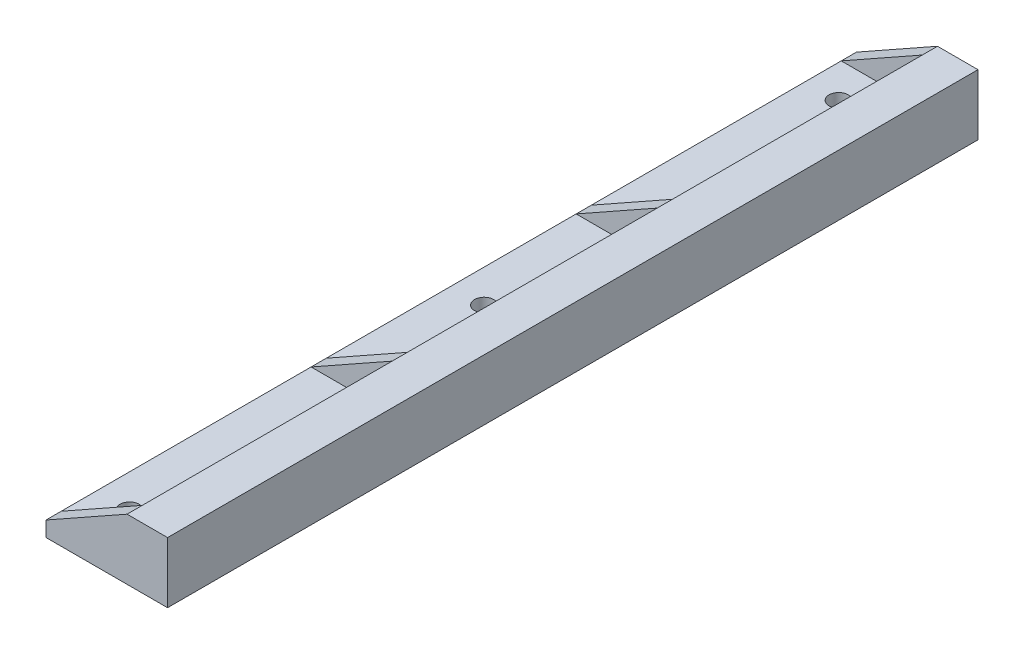
ISO-10303-21;
HEADER;
FILE_DESCRIPTION(('STEP AP214'),'2;1');
FILE_NAME('part.step','',(''),(''),'','','');
FILE_SCHEMA(('AUTOMOTIVE_DESIGN { 1 0 10303 214 1 1 1 1 }'));
ENDSEC;
DATA;
#1=APPLICATION_CONTEXT('core data for automotive mechanical design processes');
#2=APPLICATION_PROTOCOL_DEFINITION('international standard','automotive_design',2000,#1);
#3=PRODUCT_CONTEXT('',#1,'mechanical');
#4=PRODUCT('Part','Part','',(#3));
#5=PRODUCT_RELATED_PRODUCT_CATEGORY('part','',(#4));
#6=PRODUCT_DEFINITION_FORMATION('','',#4);
#7=PRODUCT_DEFINITION_CONTEXT('part definition',#1,'design');
#8=PRODUCT_DEFINITION('design','',#6,#7);
#9=PRODUCT_DEFINITION_SHAPE('','',#8);
#10=(LENGTH_UNIT() NAMED_UNIT(*) SI_UNIT(.MILLI.,.METRE.));
#11=(NAMED_UNIT(*) PLANE_ANGLE_UNIT() SI_UNIT($,.RADIAN.));
#12=(NAMED_UNIT(*) SI_UNIT($,.STERADIAN.) SOLID_ANGLE_UNIT());
#13=UNCERTAINTY_MEASURE_WITH_UNIT(LENGTH_MEASURE(1.E-05),#10,'distance_accuracy_value','');
#14=(GEOMETRIC_REPRESENTATION_CONTEXT(3) GLOBAL_UNCERTAINTY_ASSIGNED_CONTEXT((#13)) GLOBAL_UNIT_ASSIGNED_CONTEXT((#10,
#11,#12)) REPRESENTATION_CONTEXT('',''));
#15=CARTESIAN_POINT('',(0.,0.,0.));
#16=DIRECTION('',(0.,0.,1.));
#17=DIRECTION('',(1.,0.,0.));
#18=AXIS2_PLACEMENT_3D('',#15,#16,#17);
#19=CARTESIAN_POINT('',(-11.,6.,160.));
#20=DIRECTION('',(0.,0.,-1.));
#21=DIRECTION('',(-1.,0.,0.));
#22=AXIS2_PLACEMENT_3D('',#19,#20,#21);
#23=CYLINDRICAL_SURFACE('',#22,3.);
#24=CARTESIAN_POINT('',(-11.,6.,157.));
#25=DIRECTION('',(0.,0.,1.));
#26=DIRECTION('',(1.,0.,0.));
#27=AXIS2_PLACEMENT_3D('',#24,#25,#26);
#28=CIRCLE('',#27,3.);
#29=CARTESIAN_POINT('',(-8.,6.,157.));
#30=VERTEX_POINT('',#29);
#31=CARTESIAN_POINT('',(-11.,3.,157.));
#32=VERTEX_POINT('',#31);
#33=EDGE_CURVE('E212',#30,#32,#28,.F.);
#34=ORIENTED_EDGE('',*,*,#33,.F.);
#35=DIRECTION('',(0.,0.,-1.));
#36=VECTOR('',#35,1.);
#37=CARTESIAN_POINT('',(-8.,6.,160.));
#38=LINE('',#37,#36);
#39=CARTESIAN_POINT('',(-8.,6.,107.66666666));
#40=VERTEX_POINT('',#39);
#41=EDGE_CURVE('E294',#30,#40,#38,.T.);
#42=ORIENTED_EDGE('',*,*,#41,.T.);
#43=CARTESIAN_POINT('',(-11.,6.,107.66666666));
#44=DIRECTION('',(0.,0.,1.));
#45=DIRECTION('',(1.,0.,0.));
#46=AXIS2_PLACEMENT_3D('',#43,#44,#45);
#47=CIRCLE('',#46,3.);
#48=CARTESIAN_POINT('',(-11.,3.,107.66666666));
#49=VERTEX_POINT('',#48);
#50=EDGE_CURVE('E232',#40,#49,#47,.F.);
#51=ORIENTED_EDGE('',*,*,#50,.T.);
#52=DIRECTION('',(0.,0.,-1.));
#53=VECTOR('',#52,1.);
#54=CARTESIAN_POINT('',(-11.,3.,160.));
#55=LINE('',#54,#53);
#56=EDGE_CURVE('E61',#32,#49,#55,.T.);
#57=ORIENTED_EDGE('',*,*,#56,.F.);
#58=EDGE_LOOP('',(#34,#42,#51,#57));
#59=FACE_BOUND('',#58,.T.);
#60=ADVANCED_FACE('F38',(#59),#23,.F.);
#61=CARTESIAN_POINT('',(-11.,3.,160.));
#62=DIRECTION('',(0.,-1.,0.));
#63=DIRECTION('',(1.,0.,0.));
#64=AXIS2_PLACEMENT_3D('',#61,#62,#63);
#65=PLANE('',#64);
#66=CARTESIAN_POINT('',(-17.4997499999984,3.,150.));
#67=DIRECTION('',(0.,-1.,0.));
#68=DIRECTION('',(1.,0.,0.));
#69=AXIS2_PLACEMENT_3D('',#66,#67,#68);
#70=CIRCLE('',#69,1.89864999999999);
#71=CARTESIAN_POINT('',(-15.6010999999984,3.,150.));
#72=VERTEX_POINT('',#71);
#73=EDGE_CURVE('E199',#72,#72,#70,.T.);
#74=ORIENTED_EDGE('',*,*,#73,.T.);
#75=EDGE_LOOP('',(#74));
#76=FACE_BOUND('',#75,.T.);
#77=DIRECTION('',(-1.,0.,0.));
#78=VECTOR('',#77,1.);
#79=CARTESIAN_POINT('',(-11.,3.,157.));
#80=LINE('',#79,#78);
#81=CARTESIAN_POINT('',(-24.,3.,157.));
#82=VERTEX_POINT('',#81);
#83=EDGE_CURVE('E210',#32,#82,#80,.T.);
#84=ORIENTED_EDGE('',*,*,#83,.F.);
#85=ORIENTED_EDGE('',*,*,#56,.T.);
#86=DIRECTION('',(-1.,0.,0.));
#87=VECTOR('',#86,1.);
#88=CARTESIAN_POINT('',(-11.,3.,107.66666666));
#89=LINE('',#88,#87);
#90=CARTESIAN_POINT('',(-24.,3.,107.66666666));
#91=VERTEX_POINT('',#90);
#92=EDGE_CURVE('E230',#49,#91,#89,.T.);
#93=ORIENTED_EDGE('',*,*,#92,.T.);
#94=DIRECTION('',(0.,0.,-1.));
#95=VECTOR('',#94,1.);
#96=CARTESIAN_POINT('',(-24.,3.,160.));
#97=LINE('',#96,#95);
#98=EDGE_CURVE('E313',#82,#91,#97,.T.);
#99=ORIENTED_EDGE('',*,*,#98,.F.);
#100=EDGE_LOOP('',(#84,#85,#93,#99));
#101=FACE_BOUND('',#100,.T.);
#102=ADVANCED_FACE('F394',(#76,#101),#65,.F.);
#103=CARTESIAN_POINT('',(-8.,12.,160.));
#104=DIRECTION('',(1.,0.,0.));
#105=DIRECTION('',(0.,0.,-1.));
#106=AXIS2_PLACEMENT_3D('',#103,#104,#105);
#107=PLANE('',#106);
#108=DIRECTION('',(0.,-1.,0.));
#109=VECTOR('',#108,1.);
#110=CARTESIAN_POINT('',(-8.,12.,157.));
#111=LINE('',#110,#109);
#112=CARTESIAN_POINT('',(-8.,12.,157.));
#113=VERTEX_POINT('',#112);
#114=EDGE_CURVE('E206',#113,#30,#111,.T.);
#115=ORIENTED_EDGE('',*,*,#114,.F.);
#116=DIRECTION('',(0.,0.,-1.));
#117=VECTOR('',#116,1.);
#118=CARTESIAN_POINT('',(-8.,12.,160.));
#119=LINE('',#118,#117);
#120=CARTESIAN_POINT('',(-8.,12.,107.66666666));
#121=VERTEX_POINT('',#120);
#122=EDGE_CURVE('E301',#113,#121,#119,.T.);
#123=ORIENTED_EDGE('',*,*,#122,.T.);
#124=DIRECTION('',(0.,-1.,0.));
#125=VECTOR('',#124,1.);
#126=CARTESIAN_POINT('',(-8.,12.,107.66666666));
#127=LINE('',#126,#125);
#128=EDGE_CURVE('E227',#121,#40,#127,.T.);
#129=ORIENTED_EDGE('',*,*,#128,.T.);
#130=ORIENTED_EDGE('',*,*,#41,.F.);
#131=EDGE_LOOP('',(#115,#123,#129,#130));
#132=FACE_BOUND('',#131,.T.);
#133=ADVANCED_FACE('F364',(#132),#107,.F.);
#134=CARTESIAN_POINT('',(-11.,6.,104.66666666));
#135=DIRECTION('',(0.,0.,1.));
#136=DIRECTION('',(1.,0.,0.));
#137=AXIS2_PLACEMENT_3D('',#134,#135,#136);
#138=CIRCLE('',#137,3.);
#139=CARTESIAN_POINT('',(-8.,6.,104.66666666));
#140=VERTEX_POINT('',#139);
#141=CARTESIAN_POINT('',(-11.,3.,104.66666666));
#142=VERTEX_POINT('',#141);
#143=EDGE_CURVE('E224',#140,#142,#138,.F.);
#144=ORIENTED_EDGE('',*,*,#143,.F.);
#145=CARTESIAN_POINT('',(-8.,6.,55.33333334));
#146=VERTEX_POINT('',#145);
#147=EDGE_CURVE('E297',#140,#146,#38,.T.);
#148=ORIENTED_EDGE('',*,*,#147,.T.);
#149=CARTESIAN_POINT('',(-11.,6.,55.33333334));
#150=DIRECTION('',(0.,0.,-1.));
#151=DIRECTION('',(-1.,0.,0.));
#152=AXIS2_PLACEMENT_3D('',#149,#150,#151);
#153=CIRCLE('',#152,3.);
#154=CARTESIAN_POINT('',(-11.,3.,55.33333334));
#155=VERTEX_POINT('',#154);
#156=EDGE_CURVE('E263',#155,#146,#153,.F.);
#157=ORIENTED_EDGE('',*,*,#156,.F.);
#158=EDGE_CURVE('E316',#142,#155,#55,.T.);
#159=ORIENTED_EDGE('',*,*,#158,.F.);
#160=EDGE_LOOP('',(#144,#148,#157,#159));
#161=FACE_BOUND('',#160,.T.);
#162=ADVANCED_FACE('F351',(#161),#23,.F.);
#163=CARTESIAN_POINT('',(-17.4997499999984,3.,80.0000000000001));
#164=DIRECTION('',(0.,-1.,0.));
#165=DIRECTION('',(1.,0.,0.));
#166=AXIS2_PLACEMENT_3D('',#163,#164,#165);
#167=CIRCLE('',#166,1.89864999999999);
#168=CARTESIAN_POINT('',(-15.6010999999984,3.,80.0000000000001));
#169=VERTEX_POINT('',#168);
#170=EDGE_CURVE('E193',#169,#169,#167,.T.);
#171=ORIENTED_EDGE('',*,*,#170,.T.);
#172=EDGE_LOOP('',(#171));
#173=FACE_BOUND('',#172,.T.);
#174=DIRECTION('',(-1.,0.,0.));
#175=VECTOR('',#174,1.);
#176=CARTESIAN_POINT('',(-11.,3.,104.66666666));
#177=LINE('',#176,#175);
#178=CARTESIAN_POINT('',(-24.,3.,104.66666666));
#179=VERTEX_POINT('',#178);
#180=EDGE_CURVE('E53',#142,#179,#177,.T.);
#181=ORIENTED_EDGE('',*,*,#180,.F.);
#182=ORIENTED_EDGE('',*,*,#158,.T.);
#183=DIRECTION('',(1.,0.,0.));
#184=VECTOR('',#183,1.);
#185=CARTESIAN_POINT('',(-11.,3.,55.33333334));
#186=LINE('',#185,#184);
#187=CARTESIAN_POINT('',(-24.,3.,55.33333334));
#188=VERTEX_POINT('',#187);
#189=EDGE_CURVE('E258',#188,#155,#186,.T.);
#190=ORIENTED_EDGE('',*,*,#189,.F.);
#191=EDGE_CURVE('E379',#179,#188,#97,.T.);
#192=ORIENTED_EDGE('',*,*,#191,.F.);
#193=EDGE_LOOP('',(#181,#182,#190,#192));
#194=FACE_BOUND('',#193,.T.);
#195=ADVANCED_FACE('F349',(#173,#194),#65,.F.);
#196=DIRECTION('',(0.,-1.,0.));
#197=VECTOR('',#196,1.);
#198=CARTESIAN_POINT('',(-8.,12.,104.66666666));
#199=LINE('',#198,#197);
#200=CARTESIAN_POINT('',(-8.,12.,104.66666666));
#201=VERTEX_POINT('',#200);
#202=EDGE_CURVE('E218',#201,#140,#199,.T.);
#203=ORIENTED_EDGE('',*,*,#202,.F.);
#204=CARTESIAN_POINT('',(-8.,12.,55.33333334));
#205=VERTEX_POINT('',#204);
#206=EDGE_CURVE('E337',#201,#205,#119,.T.);
#207=ORIENTED_EDGE('',*,*,#206,.T.);
#208=DIRECTION('',(0.,1.,0.));
#209=VECTOR('',#208,1.);
#210=CARTESIAN_POINT('',(-8.,12.,55.33333334));
#211=LINE('',#210,#209);
#212=EDGE_CURVE('E315',#146,#205,#211,.T.);
#213=ORIENTED_EDGE('',*,*,#212,.F.);
#214=ORIENTED_EDGE('',*,*,#147,.F.);
#215=EDGE_LOOP('',(#203,#207,#213,#214));
#216=FACE_BOUND('',#215,.T.);
#217=ADVANCED_FACE('F358',(#216),#107,.F.);
#218=CARTESIAN_POINT('',(-11.,6.,3.));
#219=DIRECTION('',(0.,0.,-1.));
#220=DIRECTION('',(-1.,0.,0.));
#221=AXIS2_PLACEMENT_3D('',#218,#219,#220);
#222=CIRCLE('',#221,3.);
#223=CARTESIAN_POINT('',(-11.,3.,3.));
#224=VERTEX_POINT('',#223);
#225=CARTESIAN_POINT('',(-8.,6.,3.));
#226=VERTEX_POINT('',#225);
#227=EDGE_CURVE('E251',#224,#226,#222,.F.);
#228=ORIENTED_EDGE('',*,*,#227,.F.);
#229=CARTESIAN_POINT('',(-11.,3.,52.33333334));
#230=VERTEX_POINT('',#229);
#231=EDGE_CURVE('E312',#230,#224,#55,.T.);
#232=ORIENTED_EDGE('',*,*,#231,.F.);
#233=CARTESIAN_POINT('',(-11.,6.,52.33333334));
#234=DIRECTION('',(0.,0.,-1.));
#235=DIRECTION('',(-1.,0.,0.));
#236=AXIS2_PLACEMENT_3D('',#233,#234,#235);
#237=CIRCLE('',#236,3.);
#238=CARTESIAN_POINT('',(-8.,6.,52.33333334));
#239=VERTEX_POINT('',#238);
#240=EDGE_CURVE('E268',#230,#239,#237,.F.);
#241=ORIENTED_EDGE('',*,*,#240,.T.);
#242=EDGE_CURVE('E284',#239,#226,#38,.T.);
#243=ORIENTED_EDGE('',*,*,#242,.T.);
#244=EDGE_LOOP('',(#228,#232,#241,#243));
#245=FACE_BOUND('',#244,.T.);
#246=ADVANCED_FACE('F40',(#245),#23,.F.);
#247=CARTESIAN_POINT('',(-17.4997499999984,3.,10.0000000000001));
#248=DIRECTION('',(0.,-1.,0.));
#249=DIRECTION('',(1.,0.,0.));
#250=AXIS2_PLACEMENT_3D('',#247,#248,#249);
#251=CIRCLE('',#250,1.89864999999999);
#252=CARTESIAN_POINT('',(-15.6010999999984,3.,10.0000000000001));
#253=VERTEX_POINT('',#252);
#254=EDGE_CURVE('E187',#253,#253,#251,.T.);
#255=ORIENTED_EDGE('',*,*,#254,.T.);
#256=EDGE_LOOP('',(#255));
#257=FACE_BOUND('',#256,.T.);
#258=DIRECTION('',(1.,0.,0.));
#259=VECTOR('',#258,1.);
#260=CARTESIAN_POINT('',(-11.,3.,3.));
#261=LINE('',#260,#259);
#262=CARTESIAN_POINT('',(-24.,3.,3.));
#263=VERTEX_POINT('',#262);
#264=EDGE_CURVE('E248',#263,#224,#261,.T.);
#265=ORIENTED_EDGE('',*,*,#264,.F.);
#266=CARTESIAN_POINT('',(-24.,3.,52.33333334));
#267=VERTEX_POINT('',#266);
#268=EDGE_CURVE('E308',#267,#263,#97,.T.);
#269=ORIENTED_EDGE('',*,*,#268,.F.);
#270=DIRECTION('',(1.,0.,0.));
#271=VECTOR('',#270,1.);
#272=CARTESIAN_POINT('',(-11.,3.,52.33333334));
#273=LINE('',#272,#271);
#274=EDGE_CURVE('E266',#267,#230,#273,.T.);
#275=ORIENTED_EDGE('',*,*,#274,.T.);
#276=ORIENTED_EDGE('',*,*,#231,.T.);
#277=EDGE_LOOP('',(#265,#269,#275,#276));
#278=FACE_BOUND('',#277,.T.);
#279=ADVANCED_FACE('F343',(#257,#278),#65,.F.);
#280=DIRECTION('',(0.,1.,0.));
#281=VECTOR('',#280,1.);
#282=CARTESIAN_POINT('',(-8.,12.,3.));
#283=LINE('',#282,#281);
#284=CARTESIAN_POINT('',(-8.,12.,3.));
#285=VERTEX_POINT('',#284);
#286=EDGE_CURVE('E11',#226,#285,#283,.T.);
#287=ORIENTED_EDGE('',*,*,#286,.F.);
#288=ORIENTED_EDGE('',*,*,#242,.F.);
#289=DIRECTION('',(0.,1.,0.));
#290=VECTOR('',#289,1.);
#291=CARTESIAN_POINT('',(-8.,12.,52.33333334));
#292=LINE('',#291,#290);
#293=CARTESIAN_POINT('',(-8.,12.,52.33333334));
#294=VERTEX_POINT('',#293);
#295=EDGE_CURVE('E46',#239,#294,#292,.T.);
#296=ORIENTED_EDGE('',*,*,#295,.T.);
#297=EDGE_CURVE('E296',#294,#285,#119,.T.);
#298=ORIENTED_EDGE('',*,*,#297,.T.);
#299=EDGE_LOOP('',(#287,#288,#296,#298));
#300=FACE_BOUND('',#299,.T.);
#301=ADVANCED_FACE('F323',(#300),#107,.F.);
#302=CARTESIAN_POINT('',(-24.,3.,160.));
#303=DIRECTION('',(1.,0.,0.));
#304=DIRECTION('',(0.,0.,-1.));
#305=AXIS2_PLACEMENT_3D('',#302,#303,#304);
#306=PLANE('',#305);
#307=CARTESIAN_POINT('',(-24.,3.,160.));
#308=VERTEX_POINT('',#307);
#309=EDGE_CURVE('E309',#308,#82,#97,.T.);
#310=ORIENTED_EDGE('',*,*,#309,.T.);
#311=ORIENTED_EDGE('',*,*,#98,.T.);
#312=DIRECTION('',(0.,0.,1.));
#313=VECTOR('',#312,1.);
#314=CARTESIAN_POINT('',(-24.,3.,160.));
#315=LINE('',#314,#313);
#316=EDGE_CURVE('E234',#179,#91,#315,.T.);
#317=ORIENTED_EDGE('',*,*,#316,.F.);
#318=ORIENTED_EDGE('',*,*,#191,.T.);
#319=DIRECTION('',(0.,0.,-1.));
#320=VECTOR('',#319,1.);
#321=CARTESIAN_POINT('',(-24.,3.,160.));
#322=LINE('',#321,#320);
#323=EDGE_CURVE('E270',#267,#188,#322,.F.);
#324=ORIENTED_EDGE('',*,*,#323,.F.);
#325=ORIENTED_EDGE('',*,*,#268,.T.);
#326=DIRECTION('',(0.,0.,-1.));
#327=VECTOR('',#326,1.);
#328=CARTESIAN_POINT('',(-24.,3.,160.));
#329=LINE('',#328,#327);
#330=CARTESIAN_POINT('',(-24.,3.,0.));
#331=VERTEX_POINT('',#330);
#332=EDGE_CURVE('E245',#331,#263,#329,.F.);
#333=ORIENTED_EDGE('',*,*,#332,.F.);
#334=DIRECTION('',(0.,-1.,0.));
#335=VECTOR('',#334,1.);
#336=CARTESIAN_POINT('',(-24.,3.,0.));
#337=LINE('',#336,#335);
#338=CARTESIAN_POINT('',(-24.,0.,0.));
#339=VERTEX_POINT('',#338);
#340=EDGE_CURVE('E273',#331,#339,#337,.T.);
#341=ORIENTED_EDGE('',*,*,#340,.T.);
#342=DIRECTION('',(0.,0.,-1.));
#343=VECTOR('',#342,1.);
#344=CARTESIAN_POINT('',(-24.,0.,160.));
#345=LINE('',#344,#343);
#346=CARTESIAN_POINT('',(-24.,0.,160.));
#347=VERTEX_POINT('',#346);
#348=EDGE_CURVE('E306',#347,#339,#345,.T.);
#349=ORIENTED_EDGE('',*,*,#348,.F.);
#350=DIRECTION('',(0.,-1.,0.));
#351=VECTOR('',#350,1.);
#352=CARTESIAN_POINT('',(-24.,3.,160.));
#353=LINE('',#352,#351);
#354=EDGE_CURVE('E274',#308,#347,#353,.T.);
#355=ORIENTED_EDGE('',*,*,#354,.F.);
#356=EDGE_LOOP('',(#310,#311,#317,#318,#324,#325,#333,#341,#349,#355));
#357=FACE_BOUND('',#356,.T.);
#358=ADVANCED_FACE('F378',(#357),#306,.F.);
#359=CARTESIAN_POINT('',(-24.,0.,160.));
#360=DIRECTION('',(0.,1.,0.));
#361=DIRECTION('',(0.,0.,1.));
#362=AXIS2_PLACEMENT_3D('',#359,#360,#361);
#363=PLANE('',#362);
#364=CARTESIAN_POINT('',(-4.24987499999824,0.,42.3333333400002));
#365=DIRECTION('',(0.,-1.,0.));
#366=DIRECTION('',(0.,0.,-1.));
#367=AXIS2_PLACEMENT_3D('',#364,#365,#366);
#368=CIRCLE('',#367,1.25);
#369=CARTESIAN_POINT('',(-4.24987499999824,0.,41.0833333400002));
#370=VERTEX_POINT('',#369);
#371=EDGE_CURVE('E174',#370,#370,#368,.T.);
#372=ORIENTED_EDGE('',*,*,#371,.F.);
#373=EDGE_LOOP('',(#372));
#374=FACE_BOUND('',#373,.T.);
#375=CARTESIAN_POINT('',(-4.24987499999824,0.,117.66666666));
#376=DIRECTION('',(0.,-1.,0.));
#377=DIRECTION('',(0.,0.,-1.));
#378=AXIS2_PLACEMENT_3D('',#375,#376,#377);
#379=CIRCLE('',#378,1.25);
#380=CARTESIAN_POINT('',(-4.24987499999824,0.,116.41666666));
#381=VERTEX_POINT('',#380);
#382=EDGE_CURVE('E173',#381,#381,#379,.T.);
#383=ORIENTED_EDGE('',*,*,#382,.F.);
#384=EDGE_LOOP('',(#383));
#385=FACE_BOUND('',#384,.T.);
#386=CARTESIAN_POINT('',(-17.4997499999984,0.,10.0000000000001));
#387=DIRECTION('',(0.,-1.,0.));
#388=DIRECTION('',(0.,0.,-1.));
#389=AXIS2_PLACEMENT_3D('',#386,#387,#388);
#390=CIRCLE('',#389,1.89864999999999);
#391=CARTESIAN_POINT('',(-17.4997499999984,0.,8.10135000000007));
#392=VERTEX_POINT('',#391);
#393=EDGE_CURVE('E184',#392,#392,#390,.T.);
#394=ORIENTED_EDGE('',*,*,#393,.F.);
#395=EDGE_LOOP('',(#394));
#396=FACE_BOUND('',#395,.T.);
#397=CARTESIAN_POINT('',(-17.4997499999984,0.,80.0000000000001));
#398=DIRECTION('',(0.,-1.,0.));
#399=DIRECTION('',(0.,0.,-1.));
#400=AXIS2_PLACEMENT_3D('',#397,#398,#399);
#401=CIRCLE('',#400,1.89864999999999);
#402=CARTESIAN_POINT('',(-17.4997499999984,0.,78.1013500000001));
#403=VERTEX_POINT('',#402);
#404=EDGE_CURVE('E190',#403,#403,#401,.T.);
#405=ORIENTED_EDGE('',*,*,#404,.F.);
#406=EDGE_LOOP('',(#405));
#407=FACE_BOUND('',#406,.T.);
#408=CARTESIAN_POINT('',(-17.4997499999984,0.,150.));
#409=DIRECTION('',(0.,-1.,0.));
#410=DIRECTION('',(0.,0.,-1.));
#411=AXIS2_PLACEMENT_3D('',#408,#409,#410);
#412=CIRCLE('',#411,1.89864999999999);
#413=CARTESIAN_POINT('',(-17.4997499999984,0.,148.10135));
#414=VERTEX_POINT('',#413);
#415=EDGE_CURVE('E196',#414,#414,#412,.T.);
#416=ORIENTED_EDGE('',*,*,#415,.F.);
#417=EDGE_LOOP('',(#416));
#418=FACE_BOUND('',#417,.T.);
#419=ORIENTED_EDGE('',*,*,#348,.T.);
#420=DIRECTION('',(1.,0.,0.));
#421=VECTOR('',#420,1.);
#422=CARTESIAN_POINT('',(-24.,0.,0.));
#423=LINE('',#422,#421);
#424=CARTESIAN_POINT('',(0.,0.,0.));
#425=VERTEX_POINT('',#424);
#426=EDGE_CURVE('E287',#339,#425,#423,.T.);
#427=ORIENTED_EDGE('',*,*,#426,.T.);
#428=DIRECTION('',(0.,0.,-1.));
#429=VECTOR('',#428,1.);
#430=CARTESIAN_POINT('',(0.,0.,160.));
#431=LINE('',#430,#429);
#432=CARTESIAN_POINT('',(0.,0.,160.));
#433=VERTEX_POINT('',#432);
#434=EDGE_CURVE('E304',#433,#425,#431,.T.);
#435=ORIENTED_EDGE('',*,*,#434,.F.);
#436=DIRECTION('',(1.,0.,0.));
#437=VECTOR('',#436,1.);
#438=CARTESIAN_POINT('',(-24.,0.,160.));
#439=LINE('',#438,#437);
#440=EDGE_CURVE('E276',#347,#433,#439,.T.);
#441=ORIENTED_EDGE('',*,*,#440,.F.);
#442=EDGE_LOOP('',(#419,#427,#435,#441));
#443=FACE_BOUND('',#442,.T.);
#444=ADVANCED_FACE('F482',(#374,#385,#396,#407,#418,#443),#363,.F.);
#445=CARTESIAN_POINT('',(0.,0.,160.));
#446=DIRECTION('',(-1.,0.,0.));
#447=DIRECTION('',(0.,0.,1.));
#448=AXIS2_PLACEMENT_3D('',#445,#446,#447);
#449=PLANE('',#448);
#450=ORIENTED_EDGE('',*,*,#434,.T.);
#451=DIRECTION('',(0.,1.,0.));
#452=VECTOR('',#451,1.);
#453=CARTESIAN_POINT('',(0.,0.,0.));
#454=LINE('',#453,#452);
#455=CARTESIAN_POINT('',(0.,12.,0.));
#456=VERTEX_POINT('',#455);
#457=EDGE_CURVE('E290',#425,#456,#454,.T.);
#458=ORIENTED_EDGE('',*,*,#457,.T.);
#459=DIRECTION('',(0.,0.,-1.));
#460=VECTOR('',#459,1.);
#461=CARTESIAN_POINT('',(0.,12.,160.));
#462=LINE('',#461,#460);
#463=CARTESIAN_POINT('',(0.,12.,160.));
#464=VERTEX_POINT('',#463);
#465=EDGE_CURVE('E300',#464,#456,#462,.T.);
#466=ORIENTED_EDGE('',*,*,#465,.F.);
#467=DIRECTION('',(0.,1.,0.));
#468=VECTOR('',#467,1.);
#469=CARTESIAN_POINT('',(0.,0.,160.));
#470=LINE('',#469,#468);
#471=EDGE_CURVE('E279',#433,#464,#470,.T.);
#472=ORIENTED_EDGE('',*,*,#471,.F.);
#473=EDGE_LOOP('',(#450,#458,#466,#472));
#474=FACE_BOUND('',#473,.T.);
#475=ADVANCED_FACE('F486',(#474),#449,.F.);
#476=CARTESIAN_POINT('',(0.,12.,160.));
#477=DIRECTION('',(0.,-1.,0.));
#478=DIRECTION('',(1.,0.,0.));
#479=AXIS2_PLACEMENT_3D('',#476,#477,#478);
#480=PLANE('',#479);
#481=ORIENTED_EDGE('',*,*,#465,.T.);
#482=DIRECTION('',(-1.,0.,0.));
#483=VECTOR('',#482,1.);
#484=CARTESIAN_POINT('',(0.,12.,0.));
#485=LINE('',#484,#483);
#486=CARTESIAN_POINT('',(-8.,12.,0.));
#487=VERTEX_POINT('',#486);
#488=EDGE_CURVE('E277',#456,#487,#485,.T.);
#489=ORIENTED_EDGE('',*,*,#488,.T.);
#490=DIRECTION('',(0.,0.,-1.));
#491=VECTOR('',#490,1.);
#492=CARTESIAN_POINT('',(-8.,12.,160.));
#493=LINE('',#492,#491);
#494=EDGE_CURVE('E241',#487,#285,#493,.F.);
#495=ORIENTED_EDGE('',*,*,#494,.T.);
#496=ORIENTED_EDGE('',*,*,#297,.F.);
#497=EDGE_CURVE('E302',#205,#294,#119,.T.);
#498=ORIENTED_EDGE('',*,*,#497,.F.);
#499=ORIENTED_EDGE('',*,*,#206,.F.);
#500=EDGE_CURVE('E333',#121,#201,#119,.T.);
#501=ORIENTED_EDGE('',*,*,#500,.F.);
#502=ORIENTED_EDGE('',*,*,#122,.F.);
#503=CARTESIAN_POINT('',(-8.,12.,160.));
#504=VERTEX_POINT('',#503);
#505=EDGE_CURVE('E298',#504,#113,#119,.T.);
#506=ORIENTED_EDGE('',*,*,#505,.F.);
#507=DIRECTION('',(-1.,0.,0.));
#508=VECTOR('',#507,1.);
#509=CARTESIAN_POINT('',(0.,12.,160.));
#510=LINE('',#509,#508);
#511=EDGE_CURVE('E281',#464,#504,#510,.T.);
#512=ORIENTED_EDGE('',*,*,#511,.F.);
#513=EDGE_LOOP('',(#481,#489,#495,#496,#498,#499,#501,#502,#506,#512));
#514=FACE_BOUND('',#513,.T.);
#515=ADVANCED_FACE('F331',(#514),#480,.F.);
#516=CARTESIAN_POINT('',(-11.,6.,160.));
#517=DIRECTION('',(0.,0.,-1.));
#518=DIRECTION('',(-1.,0.,0.));
#519=AXIS2_PLACEMENT_3D('',#516,#517,#518);
#520=PLANE('',#519);
#521=DIRECTION('',(-0.871575537124549,-0.490261239632559,0.));
#522=VECTOR('',#521,1.);
#523=CARTESIAN_POINT('',(-8.,12.,160.));
#524=LINE('',#523,#522);
#525=EDGE_CURVE('E203',#504,#308,#524,.T.);
#526=ORIENTED_EDGE('',*,*,#525,.T.);
#527=ORIENTED_EDGE('',*,*,#354,.T.);
#528=ORIENTED_EDGE('',*,*,#440,.T.);
#529=ORIENTED_EDGE('',*,*,#471,.T.);
#530=ORIENTED_EDGE('',*,*,#511,.T.);
#531=EDGE_LOOP('',(#526,#527,#528,#529,#530));
#532=FACE_BOUND('',#531,.T.);
#533=ADVANCED_FACE('F534',(#532),#520,.F.);
#534=CARTESIAN_POINT('',(-11.,6.,0.));
#535=DIRECTION('',(0.,0.,-1.));
#536=DIRECTION('',(-1.,0.,0.));
#537=AXIS2_PLACEMENT_3D('',#534,#535,#536);
#538=PLANE('',#537);
#539=DIRECTION('',(-0.871575537124549,-0.490261239632559,0.));
#540=VECTOR('',#539,1.);
#541=CARTESIAN_POINT('',(-8.,12.,0.));
#542=LINE('',#541,#540);
#543=EDGE_CURVE('E238',#487,#331,#542,.T.);
#544=ORIENTED_EDGE('',*,*,#543,.F.);
#545=ORIENTED_EDGE('',*,*,#488,.F.);
#546=ORIENTED_EDGE('',*,*,#457,.F.);
#547=ORIENTED_EDGE('',*,*,#426,.F.);
#548=ORIENTED_EDGE('',*,*,#340,.F.);
#549=EDGE_LOOP('',(#544,#545,#546,#547,#548));
#550=FACE_BOUND('',#549,.T.);
#551=ADVANCED_FACE('F545',(#550),#538,.T.);
#552=CARTESIAN_POINT('',(-8.,12.,53.83333334));
#553=DIRECTION('',(0.490261239632559,-0.871575537124549,0.));
#554=DIRECTION('',(-0.871575537124549,-0.490261239632559,0.));
#555=AXIS2_PLACEMENT_3D('',#552,#553,#554);
#556=PLANE('',#555);
#557=DIRECTION('',(-0.871575537124549,-0.490261239632559,0.));
#558=VECTOR('',#557,1.);
#559=CARTESIAN_POINT('',(-8.,12.,52.33333334));
#560=LINE('',#559,#558);
#561=EDGE_CURVE('E255',#294,#267,#560,.T.);
#562=ORIENTED_EDGE('',*,*,#561,.T.);
#563=ORIENTED_EDGE('',*,*,#323,.T.);
#564=DIRECTION('',(-0.871575537124549,-0.490261239632559,0.));
#565=VECTOR('',#564,1.);
#566=CARTESIAN_POINT('',(-8.,12.,55.33333334));
#567=LINE('',#566,#565);
#568=EDGE_CURVE('E254',#205,#188,#567,.T.);
#569=ORIENTED_EDGE('',*,*,#568,.F.);
#570=ORIENTED_EDGE('',*,*,#497,.T.);
#571=EDGE_LOOP('',(#562,#563,#569,#570));
#572=FACE_BOUND('',#571,.T.);
#573=ADVANCED_FACE('F336',(#572),#556,.F.);
#574=CARTESIAN_POINT('',(-12.,6.,52.33333334));
#575=DIRECTION('',(0.,0.,-1.));
#576=DIRECTION('',(-1.,0.,0.));
#577=AXIS2_PLACEMENT_3D('',#574,#575,#576);
#578=PLANE('',#577);
#579=ORIENTED_EDGE('',*,*,#240,.F.);
#580=ORIENTED_EDGE('',*,*,#274,.F.);
#581=ORIENTED_EDGE('',*,*,#561,.F.);
#582=ORIENTED_EDGE('',*,*,#295,.F.);
#583=EDGE_LOOP('',(#579,#580,#581,#582));
#584=FACE_BOUND('',#583,.T.);
#585=ADVANCED_FACE('F339',(#584),#578,.T.);
#586=CARTESIAN_POINT('',(-12.,6.,55.33333334));
#587=DIRECTION('',(0.,0.,-1.));
#588=DIRECTION('',(-1.,0.,0.));
#589=AXIS2_PLACEMENT_3D('',#586,#587,#588);
#590=PLANE('',#589);
#591=ORIENTED_EDGE('',*,*,#189,.T.);
#592=ORIENTED_EDGE('',*,*,#156,.T.);
#593=ORIENTED_EDGE('',*,*,#212,.T.);
#594=ORIENTED_EDGE('',*,*,#568,.T.);
#595=EDGE_LOOP('',(#591,#592,#593,#594));
#596=FACE_BOUND('',#595,.T.);
#597=ADVANCED_FACE('F355',(#596),#590,.F.);
#598=CARTESIAN_POINT('',(-12.,6.,3.));
#599=DIRECTION('',(0.,0.,-1.));
#600=DIRECTION('',(-1.,0.,0.));
#601=AXIS2_PLACEMENT_3D('',#598,#599,#600);
#602=PLANE('',#601);
#603=ORIENTED_EDGE('',*,*,#264,.T.);
#604=ORIENTED_EDGE('',*,*,#227,.T.);
#605=ORIENTED_EDGE('',*,*,#286,.T.);
#606=DIRECTION('',(-0.871575537124549,-0.490261239632559,0.));
#607=VECTOR('',#606,1.);
#608=CARTESIAN_POINT('',(-8.,12.,3.));
#609=LINE('',#608,#607);
#610=EDGE_CURVE('E237',#285,#263,#609,.T.);
#611=ORIENTED_EDGE('',*,*,#610,.T.);
#612=EDGE_LOOP('',(#603,#604,#605,#611));
#613=FACE_BOUND('',#612,.T.);
#614=ADVANCED_FACE('F550',(#613),#602,.F.);
#615=CARTESIAN_POINT('',(-8.,12.,0.));
#616=DIRECTION('',(0.490261239632559,-0.871575537124549,0.));
#617=DIRECTION('',(-0.871575537124549,-0.490261239632559,0.));
#618=AXIS2_PLACEMENT_3D('',#615,#616,#617);
#619=PLANE('',#618);
#620=ORIENTED_EDGE('',*,*,#543,.T.);
#621=ORIENTED_EDGE('',*,*,#332,.T.);
#622=ORIENTED_EDGE('',*,*,#610,.F.);
#623=ORIENTED_EDGE('',*,*,#494,.F.);
#624=EDGE_LOOP('',(#620,#621,#622,#623));
#625=FACE_BOUND('',#624,.T.);
#626=ADVANCED_FACE('F391',(#625),#619,.F.);
#627=CARTESIAN_POINT('',(-12.,6.,107.66666666));
#628=DIRECTION('',(0.,0.,1.));
#629=DIRECTION('',(1.,0.,0.));
#630=AXIS2_PLACEMENT_3D('',#627,#628,#629);
#631=PLANE('',#630);
#632=ORIENTED_EDGE('',*,*,#50,.F.);
#633=ORIENTED_EDGE('',*,*,#128,.F.);
#634=DIRECTION('',(-0.871575537124549,-0.490261239632559,0.));
#635=VECTOR('',#634,1.);
#636=CARTESIAN_POINT('',(-8.,12.,107.66666666));
#637=LINE('',#636,#635);
#638=EDGE_CURVE('E215',#121,#91,#637,.T.);
#639=ORIENTED_EDGE('',*,*,#638,.T.);
#640=ORIENTED_EDGE('',*,*,#92,.F.);
#641=EDGE_LOOP('',(#632,#633,#639,#640));
#642=FACE_BOUND('',#641,.T.);
#643=ADVANCED_FACE('F373',(#642),#631,.T.);
#644=CARTESIAN_POINT('',(-12.,6.,104.66666666));
#645=DIRECTION('',(0.,0.,1.));
#646=DIRECTION('',(1.,0.,0.));
#647=AXIS2_PLACEMENT_3D('',#644,#645,#646);
#648=PLANE('',#647);
#649=ORIENTED_EDGE('',*,*,#202,.T.);
#650=ORIENTED_EDGE('',*,*,#143,.T.);
#651=ORIENTED_EDGE('',*,*,#180,.T.);
#652=DIRECTION('',(-0.871575537124549,-0.490261239632559,0.));
#653=VECTOR('',#652,1.);
#654=CARTESIAN_POINT('',(-8.,12.,104.66666666));
#655=LINE('',#654,#653);
#656=EDGE_CURVE('E214',#201,#179,#655,.T.);
#657=ORIENTED_EDGE('',*,*,#656,.F.);
#658=EDGE_LOOP('',(#649,#650,#651,#657));
#659=FACE_BOUND('',#658,.T.);
#660=ADVANCED_FACE('F382',(#659),#648,.F.);
#661=CARTESIAN_POINT('',(-8.,12.,106.16666666));
#662=DIRECTION('',(-0.490261239632559,0.871575537124549,0.));
#663=DIRECTION('',(-0.871575537124549,-0.490261239632559,0.));
#664=AXIS2_PLACEMENT_3D('',#661,#662,#663);
#665=PLANE('',#664);
#666=ORIENTED_EDGE('',*,*,#656,.T.);
#667=ORIENTED_EDGE('',*,*,#316,.T.);
#668=ORIENTED_EDGE('',*,*,#638,.F.);
#669=ORIENTED_EDGE('',*,*,#500,.T.);
#670=EDGE_LOOP('',(#666,#667,#668,#669));
#671=FACE_BOUND('',#670,.T.);
#672=ADVANCED_FACE('F375',(#671),#665,.T.);
#673=CARTESIAN_POINT('',(-12.,6.,157.));
#674=DIRECTION('',(0.,0.,1.));
#675=DIRECTION('',(1.,0.,0.));
#676=AXIS2_PLACEMENT_3D('',#673,#674,#675);
#677=PLANE('',#676);
#678=ORIENTED_EDGE('',*,*,#114,.T.);
#679=ORIENTED_EDGE('',*,*,#33,.T.);
#680=ORIENTED_EDGE('',*,*,#83,.T.);
#681=DIRECTION('',(-0.871575537124549,-0.490261239632559,0.));
#682=VECTOR('',#681,1.);
#683=CARTESIAN_POINT('',(-8.,12.,157.));
#684=LINE('',#683,#682);
#685=EDGE_CURVE('E202',#113,#82,#684,.T.);
#686=ORIENTED_EDGE('',*,*,#685,.F.);
#687=EDGE_LOOP('',(#678,#679,#680,#686));
#688=FACE_BOUND('',#687,.T.);
#689=ADVANCED_FACE('F389',(#688),#677,.F.);
#690=CARTESIAN_POINT('',(-8.,12.,160.));
#691=DIRECTION('',(-0.490261239632559,0.871575537124549,0.));
#692=DIRECTION('',(-0.871575537124549,-0.490261239632559,0.));
#693=AXIS2_PLACEMENT_3D('',#690,#691,#692);
#694=PLANE('',#693);
#695=ORIENTED_EDGE('',*,*,#685,.T.);
#696=ORIENTED_EDGE('',*,*,#309,.F.);
#697=ORIENTED_EDGE('',*,*,#525,.F.);
#698=ORIENTED_EDGE('',*,*,#505,.T.);
#699=EDGE_LOOP('',(#695,#696,#697,#698));
#700=FACE_BOUND('',#699,.T.);
#701=ADVANCED_FACE('F452',(#700),#694,.T.);
#702=CARTESIAN_POINT('',(-17.4997499999984,0.,150.));
#703=DIRECTION('',(0.,-1.,0.));
#704=DIRECTION('',(0.,0.,-1.));
#705=AXIS2_PLACEMENT_3D('',#702,#703,#704);
#706=CYLINDRICAL_SURFACE('',#705,1.89864999999999);
#707=ORIENTED_EDGE('',*,*,#415,.T.);
#708=EDGE_LOOP('',(#707));
#709=FACE_BOUND('',#708,.T.);
#710=ORIENTED_EDGE('',*,*,#73,.F.);
#711=EDGE_LOOP('',(#710));
#712=FACE_BOUND('',#711,.T.);
#713=ADVANCED_FACE('F446',(#709,#712),#706,.F.);
#714=CARTESIAN_POINT('',(-17.4997499999984,0.,80.0000000000001));
#715=DIRECTION('',(0.,-1.,0.));
#716=DIRECTION('',(0.,0.,-1.));
#717=AXIS2_PLACEMENT_3D('',#714,#715,#716);
#718=CYLINDRICAL_SURFACE('',#717,1.89864999999999);
#719=ORIENTED_EDGE('',*,*,#404,.T.);
#720=EDGE_LOOP('',(#719));
#721=FACE_BOUND('',#720,.T.);
#722=ORIENTED_EDGE('',*,*,#170,.F.);
#723=EDGE_LOOP('',(#722));
#724=FACE_BOUND('',#723,.T.);
#725=ADVANCED_FACE('F451',(#721,#724),#718,.F.);
#726=CARTESIAN_POINT('',(-17.4997499999984,0.,10.0000000000001));
#727=DIRECTION('',(0.,-1.,0.));
#728=DIRECTION('',(0.,0.,-1.));
#729=AXIS2_PLACEMENT_3D('',#726,#727,#728);
#730=CYLINDRICAL_SURFACE('',#729,1.89864999999999);
#731=ORIENTED_EDGE('',*,*,#393,.T.);
#732=EDGE_LOOP('',(#731));
#733=FACE_BOUND('',#732,.T.);
#734=ORIENTED_EDGE('',*,*,#254,.F.);
#735=EDGE_LOOP('',(#734));
#736=FACE_BOUND('',#735,.T.);
#737=ADVANCED_FACE('F464',(#733,#736),#730,.F.);
#738=CARTESIAN_POINT('',(-4.24987499999824,5.,117.66666666));
#739=DIRECTION('',(0.,-1.,0.));
#740=DIRECTION('',(0.,0.,-1.));
#741=AXIS2_PLACEMENT_3D('',#738,#739,#740);
#742=CONICAL_SURFACE('',#741,1.25,1.02974425867665);
#743=CARTESIAN_POINT('',(-4.24987499999824,5.75107577378445,117.66666666));
#744=VERTEX_POINT('',#743);
#745=VERTEX_LOOP('',#744);
#746=FACE_BOUND('',#745,.T.);
#747=CARTESIAN_POINT('',(-4.24987499999824,5.,117.66666666));
#748=DIRECTION('',(0.,-1.,0.));
#749=DIRECTION('',(0.,0.,-1.));
#750=AXIS2_PLACEMENT_3D('',#747,#748,#749);
#751=CIRCLE('',#750,1.25);
#752=CARTESIAN_POINT('',(-4.24987499999824,5.,116.41666666));
#753=VERTEX_POINT('',#752);
#754=EDGE_CURVE('E177',#753,#753,#751,.T.);
#755=ORIENTED_EDGE('',*,*,#754,.T.);
#756=EDGE_LOOP('',(#755));
#757=FACE_BOUND('',#756,.T.);
#758=ADVANCED_FACE('F474',(#746,#757),#742,.F.);
#759=CARTESIAN_POINT('',(-4.24987499999824,0.,117.66666666));
#760=DIRECTION('',(0.,-1.,0.));
#761=DIRECTION('',(0.,0.,-1.));
#762=AXIS2_PLACEMENT_3D('',#759,#760,#761);
#763=CYLINDRICAL_SURFACE('',#762,1.25);
#764=ORIENTED_EDGE('',*,*,#754,.F.);
#765=EDGE_LOOP('',(#764));
#766=FACE_BOUND('',#765,.T.);
#767=ORIENTED_EDGE('',*,*,#382,.T.);
#768=EDGE_LOOP('',(#767));
#769=FACE_BOUND('',#768,.T.);
#770=ADVANCED_FACE('F167',(#766,#769),#763,.F.);
#771=CARTESIAN_POINT('',(-4.24987499999824,5.,42.3333333400002));
#772=DIRECTION('',(0.,-1.,0.));
#773=DIRECTION('',(0.,0.,-1.));
#774=AXIS2_PLACEMENT_3D('',#771,#772,#773);
#775=CONICAL_SURFACE('',#774,1.25,1.02974425867665);
#776=CARTESIAN_POINT('',(-4.24987499999824,5.75107577378445,42.3333333400002));
#777=VERTEX_POINT('',#776);
#778=VERTEX_LOOP('',#777);
#779=FACE_BOUND('',#778,.T.);
#780=CARTESIAN_POINT('',(-4.24987499999824,5.,42.3333333400002));
#781=DIRECTION('',(0.,-1.,0.));
#782=DIRECTION('',(0.,0.,-1.));
#783=AXIS2_PLACEMENT_3D('',#780,#781,#782);
#784=CIRCLE('',#783,1.25);
#785=CARTESIAN_POINT('',(-4.24987499999824,5.,41.0833333400002));
#786=VERTEX_POINT('',#785);
#787=EDGE_CURVE('E171',#786,#786,#784,.T.);
#788=ORIENTED_EDGE('',*,*,#787,.T.);
#789=EDGE_LOOP('',(#788));
#790=FACE_BOUND('',#789,.T.);
#791=ADVANCED_FACE('F163',(#779,#790),#775,.F.);
#792=CARTESIAN_POINT('',(-4.24987499999824,0.,42.3333333400002));
#793=DIRECTION('',(0.,-1.,0.));
#794=DIRECTION('',(0.,0.,-1.));
#795=AXIS2_PLACEMENT_3D('',#792,#793,#794);
#796=CYLINDRICAL_SURFACE('',#795,1.25);
#797=ORIENTED_EDGE('',*,*,#787,.F.);
#798=EDGE_LOOP('',(#797));
#799=FACE_BOUND('',#798,.T.);
#800=ORIENTED_EDGE('',*,*,#371,.T.);
#801=EDGE_LOOP('',(#800));
#802=FACE_BOUND('',#801,.T.);
#803=ADVANCED_FACE('F166',(#799,#802),#796,.F.);
#804=CLOSED_SHELL('',(#60,#102,#133,#162,#195,#217,#246,#279,#301,#358,#444,#475,#515,#533,#551,
#573,#585,#597,#614,#626,#643,#660,#672,#689,#701,#713,#725,#737,#758,#770,#791,#803));
#805=MANIFOLD_SOLID_BREP('B2',#804);
#806=ADVANCED_BREP_SHAPE_REPRESENTATION('',(#18,#805),#14);
#807=SHAPE_DEFINITION_REPRESENTATION(#9,#806);
ENDSEC;
END-ISO-10303-21;
